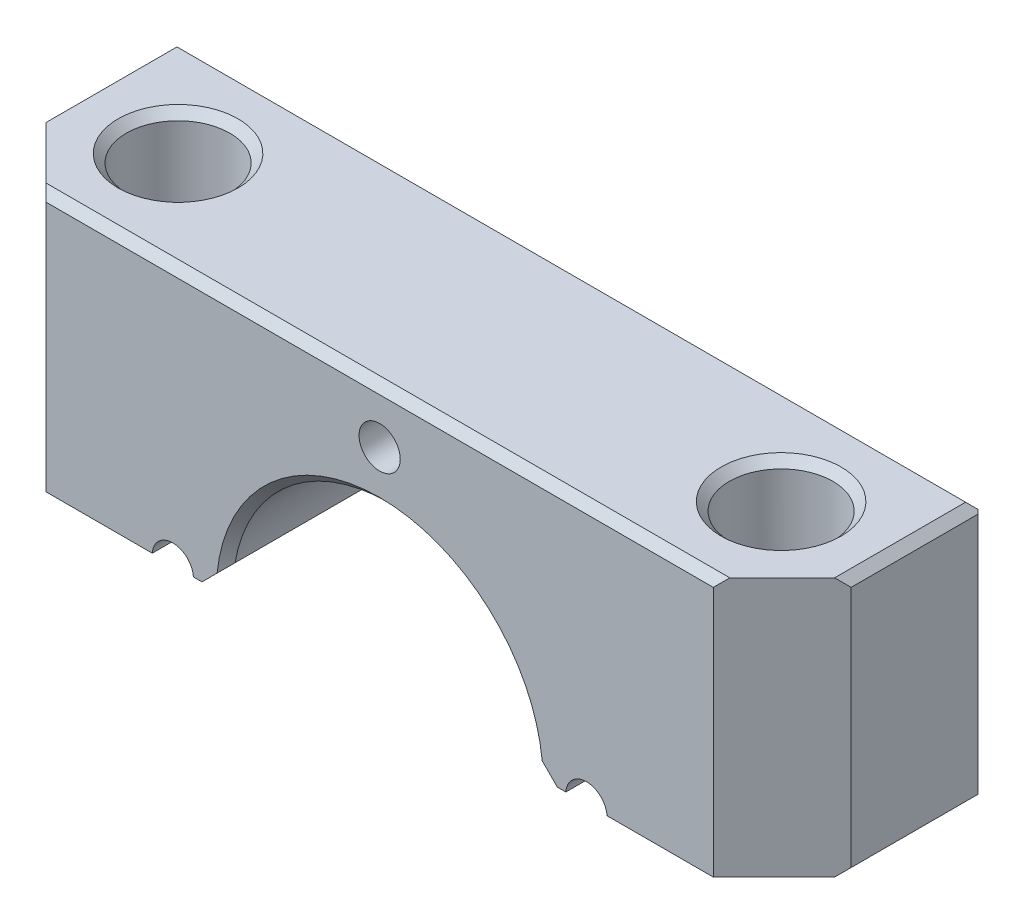
ISO-10303-21;
HEADER;
FILE_DESCRIPTION(('STEP AP214'),'2;1');
FILE_NAME('part.step','',(''),(''),'','','');
FILE_SCHEMA(('AUTOMOTIVE_DESIGN { 1 0 10303 214 1 1 1 1 }'));
ENDSEC;
DATA;
#1=APPLICATION_CONTEXT('core data for automotive mechanical design processes');
#2=APPLICATION_PROTOCOL_DEFINITION('international standard','automotive_design',2000,#1);
#3=PRODUCT_CONTEXT('',#1,'mechanical');
#4=PRODUCT('Part','Part','',(#3));
#5=PRODUCT_RELATED_PRODUCT_CATEGORY('part','',(#4));
#6=PRODUCT_DEFINITION_FORMATION('','',#4);
#7=PRODUCT_DEFINITION_CONTEXT('part definition',#1,'design');
#8=PRODUCT_DEFINITION('design','',#6,#7);
#9=PRODUCT_DEFINITION_SHAPE('','',#8);
#10=(LENGTH_UNIT() NAMED_UNIT(*) SI_UNIT(.MILLI.,.METRE.));
#11=(NAMED_UNIT(*) PLANE_ANGLE_UNIT() SI_UNIT($,.RADIAN.));
#12=(NAMED_UNIT(*) SI_UNIT($,.STERADIAN.) SOLID_ANGLE_UNIT());
#13=UNCERTAINTY_MEASURE_WITH_UNIT(LENGTH_MEASURE(1.E-05),#10,'distance_accuracy_value','');
#14=(GEOMETRIC_REPRESENTATION_CONTEXT(3) GLOBAL_UNCERTAINTY_ASSIGNED_CONTEXT((#13)) GLOBAL_UNIT_ASSIGNED_CONTEXT((#10,
#11,#12)) REPRESENTATION_CONTEXT('',''));
#15=CARTESIAN_POINT('',(0.,0.,0.));
#16=DIRECTION('',(0.,0.,1.));
#17=DIRECTION('',(1.,0.,0.));
#18=AXIS2_PLACEMENT_3D('',#15,#16,#17);
#19=CARTESIAN_POINT('',(-37.084,0.,18.415));
#20=DIRECTION('',(0.,1.,0.));
#21=DIRECTION('',(-1.,0.,0.));
#22=AXIS2_PLACEMENT_3D('',#19,#20,#21);
#23=PLANE('',#22);
#24=CARTESIAN_POINT('',(-27.7749,0.,9.2075));
#25=DIRECTION('',(0.,1.,0.));
#26=DIRECTION('',(0.,0.,1.));
#27=AXIS2_PLACEMENT_3D('',#24,#25,#26);
#28=CIRCLE('',#27,4.76249999999999);
#29=CARTESIAN_POINT('',(-27.7749,0.,13.97));
#30=VERTEX_POINT('',#29);
#31=EDGE_CURVE('E296',#30,#30,#28,.T.);
#32=ORIENTED_EDGE('',*,*,#31,.T.);
#33=EDGE_LOOP('',(#32));
#34=FACE_BOUND('',#33,.T.);
#35=DIRECTION('',(0.707106781186546,0.,0.707106781186549));
#36=VECTOR('',#35,1.);
#37=CARTESIAN_POINT('',(-30.734,0.,18.415));
#38=LINE('',#37,#36);
#39=CARTESIAN_POINT('',(-30.734,0.,18.415));
#40=VERTEX_POINT('',#39);
#41=CARTESIAN_POINT('',(-36.322,0.,12.827));
#42=VERTEX_POINT('',#41);
#43=EDGE_CURVE('E451',#40,#42,#38,.F.);
#44=ORIENTED_EDGE('',*,*,#43,.T.);
#45=DIRECTION('',(0.,0.,-1.));
#46=VECTOR('',#45,1.);
#47=CARTESIAN_POINT('',(-36.322,0.,18.415));
#48=LINE('',#47,#46);
#49=CARTESIAN_POINT('',(-36.322,0.,0.));
#50=VERTEX_POINT('',#49);
#51=EDGE_CURVE('E233',#42,#50,#48,.T.);
#52=ORIENTED_EDGE('',*,*,#51,.T.);
#53=DIRECTION('',(1.,0.,0.));
#54=VECTOR('',#53,1.);
#55=CARTESIAN_POINT('',(-37.084,0.,0.));
#56=LINE('',#55,#54);
#57=CARTESIAN_POINT('',(-20.9443977466467,0.,0.));
#58=VERTEX_POINT('',#57);
#59=EDGE_CURVE('E227',#50,#58,#56,.T.);
#60=ORIENTED_EDGE('',*,*,#59,.T.);
#61=DIRECTION('',(0.,0.,1.));
#62=VECTOR('',#61,1.);
#63=CARTESIAN_POINT('',(-20.9443977466467,0.,18.415));
#64=LINE('',#63,#62);
#65=CARTESIAN_POINT('',(-20.9443977466467,0.,18.415));
#66=VERTEX_POINT('',#65);
#67=EDGE_CURVE('E231',#58,#66,#64,.T.);
#68=ORIENTED_EDGE('',*,*,#67,.T.);
#69=DIRECTION('',(1.,0.,0.));
#70=VECTOR('',#69,1.);
#71=CARTESIAN_POINT('',(-37.084,0.,18.415));
#72=LINE('',#71,#70);
#73=EDGE_CURVE('E305',#40,#66,#72,.T.);
#74=ORIENTED_EDGE('',*,*,#73,.F.);
#75=EDGE_LOOP('',(#44,#52,#60,#68,#74));
#76=FACE_BOUND('',#75,.T.);
#77=ADVANCED_FACE('F65',(#34,#76),#23,.F.);
#78=CARTESIAN_POINT('',(16.3682614394848,0.,0.));
#79=VERTEX_POINT('',#78);
#80=CARTESIAN_POINT('',(17.1556022533533,0.,0.));
#81=VERTEX_POINT('',#80);
#82=EDGE_CURVE('E239',#79,#81,#56,.T.);
#83=ORIENTED_EDGE('',*,*,#82,.T.);
#84=DIRECTION('',(0.,0.,1.));
#85=VECTOR('',#84,1.);
#86=CARTESIAN_POINT('',(17.1556022533533,0.,18.415));
#87=LINE('',#86,#85);
#88=CARTESIAN_POINT('',(17.1556022533533,0.,18.415));
#89=VERTEX_POINT('',#88);
#90=EDGE_CURVE('E267',#81,#89,#87,.T.);
#91=ORIENTED_EDGE('',*,*,#90,.T.);
#92=CARTESIAN_POINT('',(16.3682614394848,0.,18.415));
#93=VERTEX_POINT('',#92);
#94=EDGE_CURVE('E308',#93,#89,#72,.T.);
#95=ORIENTED_EDGE('',*,*,#94,.F.);
#96=DIRECTION('',(0.,0.,-1.));
#97=VECTOR('',#96,1.);
#98=CARTESIAN_POINT('',(16.3682614394848,0.,18.415));
#99=LINE('',#98,#97);
#100=EDGE_CURVE('E293',#93,#79,#99,.T.);
#101=ORIENTED_EDGE('',*,*,#100,.T.);
#102=EDGE_LOOP('',(#83,#91,#95,#101));
#103=FACE_BOUND('',#102,.T.);
#104=ADVANCED_FACE('F354',(#103),#23,.F.);
#105=CARTESIAN_POINT('',(-37.084,23.876,18.415));
#106=DIRECTION('',(0.,0.,-1.));
#107=DIRECTION('',(-1.,0.,0.));
#108=AXIS2_PLACEMENT_3D('',#105,#106,#107);
#109=PLANE('',#108);
#110=CARTESIAN_POINT('',(0.,18.923,18.415));
#111=DIRECTION('',(0.,0.,1.));
#112=DIRECTION('',(1.,0.,0.));
#113=AXIS2_PLACEMENT_3D('',#110,#111,#112);
#114=CIRCLE('',#113,1.89864999999999);
#115=CARTESIAN_POINT('',(1.89864999999999,18.923,18.415));
#116=VERTEX_POINT('',#115);
#117=EDGE_CURVE('E270',#116,#116,#114,.T.);
#118=ORIENTED_EDGE('',*,*,#117,.F.);
#119=EDGE_LOOP('',(#118));
#120=FACE_BOUND('',#119,.T.);
#121=CARTESIAN_POINT('',(20.9443977466467,0.,18.415));
#122=VERTEX_POINT('',#121);
#123=CARTESIAN_POINT('',(30.734,0.,18.415));
#124=VERTEX_POINT('',#123);
#125=EDGE_CURVE('E236',#122,#124,#72,.T.);
#126=ORIENTED_EDGE('',*,*,#125,.T.);
#127=DIRECTION('',(0.,1.,0.));
#128=VECTOR('',#127,1.);
#129=CARTESIAN_POINT('',(30.734,23.876,18.415));
#130=LINE('',#129,#128);
#131=CARTESIAN_POINT('',(30.734,23.114,18.415));
#132=VERTEX_POINT('',#131);
#133=EDGE_CURVE('E432',#124,#132,#130,.T.);
#134=ORIENTED_EDGE('',*,*,#133,.T.);
#135=DIRECTION('',(-1.,0.,0.));
#136=VECTOR('',#135,1.);
#137=CARTESIAN_POINT('',(-37.084,23.114,18.415));
#138=LINE('',#137,#136);
#139=CARTESIAN_POINT('',(-30.734,23.114,18.415));
#140=VERTEX_POINT('',#139);
#141=EDGE_CURVE('E411',#132,#140,#138,.T.);
#142=ORIENTED_EDGE('',*,*,#141,.T.);
#143=DIRECTION('',(0.,-1.,0.));
#144=VECTOR('',#143,1.);
#145=CARTESIAN_POINT('',(-30.734,23.876,18.415));
#146=LINE('',#145,#144);
#147=EDGE_CURVE('E426',#140,#40,#146,.T.);
#148=ORIENTED_EDGE('',*,*,#147,.T.);
#149=ORIENTED_EDGE('',*,*,#73,.T.);
#150=CARTESIAN_POINT('',(-19.05,-0.127,18.415));
#151=DIRECTION('',(0.,0.,1.));
#152=DIRECTION('',(1.,0.,0.));
#153=AXIS2_PLACEMENT_3D('',#150,#151,#152);
#154=CIRCLE('',#153,1.89864999999999);
#155=CARTESIAN_POINT('',(-17.1556022533533,0.,18.415));
#156=VERTEX_POINT('',#155);
#157=EDGE_CURVE('E246',#156,#66,#154,.T.);
#158=ORIENTED_EDGE('',*,*,#157,.F.);
#159=CARTESIAN_POINT('',(-16.3682614394848,0.,18.415));
#160=VERTEX_POINT('',#159);
#161=EDGE_CURVE('E307',#156,#160,#72,.T.);
#162=ORIENTED_EDGE('',*,*,#161,.T.);
#163=DIRECTION('',(0.707106781186548,0.707106781186547,0.));
#164=VECTOR('',#163,1.);
#165=CARTESIAN_POINT('',(-14.0822614394848,2.286,18.415));
#166=LINE('',#165,#164);
#167=CARTESIAN_POINT('',(-14.9722357368242,1.39602570266061,18.415));
#168=VERTEX_POINT('',#167);
#169=EDGE_CURVE('E277',#160,#168,#166,.T.);
#170=ORIENTED_EDGE('',*,*,#169,.T.);
#171=CARTESIAN_POINT('',(0.,-0.127,18.415));
#172=DIRECTION('',(0.,0.,-1.));
#173=DIRECTION('',(-1.,0.,0.));
#174=AXIS2_PLACEMENT_3D('',#171,#172,#173);
#175=CIRCLE('',#174,15.0495);
#176=CARTESIAN_POINT('',(14.9722357368242,1.39602570266061,18.415));
#177=VERTEX_POINT('',#176);
#178=EDGE_CURVE('E306',#168,#177,#175,.T.);
#179=ORIENTED_EDGE('',*,*,#178,.T.);
#180=DIRECTION('',(0.707106781186548,-0.707106781186548,0.));
#181=VECTOR('',#180,1.);
#182=CARTESIAN_POINT('',(16.3682614394848,0.,18.415));
#183=LINE('',#182,#181);
#184=EDGE_CURVE('E289',#177,#93,#183,.T.);
#185=ORIENTED_EDGE('',*,*,#184,.T.);
#186=ORIENTED_EDGE('',*,*,#94,.T.);
#187=CARTESIAN_POINT('',(19.05,-0.126999999999995,18.415));
#188=DIRECTION('',(0.,0.,1.));
#189=DIRECTION('',(1.,0.,0.));
#190=AXIS2_PLACEMENT_3D('',#187,#188,#189);
#191=CIRCLE('',#190,1.89864999999999);
#192=EDGE_CURVE('E255',#122,#89,#191,.T.);
#193=ORIENTED_EDGE('',*,*,#192,.F.);
#194=EDGE_LOOP('',(#126,#134,#142,#148,#149,#158,#162,#170,#179,#185,#186,#193));
#195=FACE_BOUND('',#194,.T.);
#196=ADVANCED_FACE('F351',(#120,#195),#109,.F.);
#197=CARTESIAN_POINT('',(-37.084,23.876,0.));
#198=DIRECTION('',(0.,0.,-1.));
#199=DIRECTION('',(-1.,0.,0.));
#200=AXIS2_PLACEMENT_3D('',#197,#198,#199);
#201=PLANE('',#200);
#202=DIRECTION('',(0.,-1.,0.));
#203=VECTOR('',#202,1.);
#204=CARTESIAN_POINT('',(36.703,0.,0.));
#205=LINE('',#204,#203);
#206=CARTESIAN_POINT('',(36.703,23.114,0.));
#207=VERTEX_POINT('',#206);
#208=CARTESIAN_POINT('',(36.703,0.381000000000034,0.));
#209=VERTEX_POINT('',#208);
#210=EDGE_CURVE('E467',#207,#209,#205,.T.);
#211=ORIENTED_EDGE('',*,*,#210,.T.);
#212=DIRECTION('',(0.707106781186551,0.707106781186544,0.));
#213=VECTOR('',#212,1.);
#214=CARTESIAN_POINT('',(11.5569999999996,-24.7650000000001,0.));
#215=LINE('',#214,#213);
#216=CARTESIAN_POINT('',(36.322,0.,0.));
#217=VERTEX_POINT('',#216);
#218=EDGE_CURVE('E480',#209,#217,#215,.F.);
#219=ORIENTED_EDGE('',*,*,#218,.T.);
#220=CARTESIAN_POINT('',(20.9443977466467,0.,0.));
#221=VERTEX_POINT('',#220);
#222=EDGE_CURVE('E304',#221,#217,#56,.T.);
#223=ORIENTED_EDGE('',*,*,#222,.F.);
#224=CARTESIAN_POINT('',(19.05,-0.126999999999995,0.));
#225=DIRECTION('',(0.,0.,1.));
#226=DIRECTION('',(1.,0.,0.));
#227=AXIS2_PLACEMENT_3D('',#224,#225,#226);
#228=CIRCLE('',#227,1.89864999999999);
#229=EDGE_CURVE('E257',#221,#81,#228,.T.);
#230=ORIENTED_EDGE('',*,*,#229,.T.);
#231=ORIENTED_EDGE('',*,*,#82,.F.);
#232=DIRECTION('',(0.707106781186548,-0.707106781186548,0.));
#233=VECTOR('',#232,1.);
#234=CARTESIAN_POINT('',(16.3682614394848,0.,0.));
#235=LINE('',#234,#233);
#236=CARTESIAN_POINT('',(14.9722357368242,1.39602570266061,0.));
#237=VERTEX_POINT('',#236);
#238=EDGE_CURVE('E286',#237,#79,#235,.T.);
#239=ORIENTED_EDGE('',*,*,#238,.F.);
#240=CARTESIAN_POINT('',(0.,-0.127,0.));
#241=DIRECTION('',(0.,0.,-1.));
#242=DIRECTION('',(-1.,0.,0.));
#243=AXIS2_PLACEMENT_3D('',#240,#241,#242);
#244=CIRCLE('',#243,15.0495);
#245=CARTESIAN_POINT('',(-14.9722357368242,1.39602570266061,0.));
#246=VERTEX_POINT('',#245);
#247=EDGE_CURVE('E384',#237,#246,#244,.F.);
#248=ORIENTED_EDGE('',*,*,#247,.T.);
#249=DIRECTION('',(0.707106781186548,0.707106781186547,0.));
#250=VECTOR('',#249,1.);
#251=CARTESIAN_POINT('',(-14.0822614394848,2.286,0.));
#252=LINE('',#251,#250);
#253=CARTESIAN_POINT('',(-16.3682614394848,0.,0.));
#254=VERTEX_POINT('',#253);
#255=EDGE_CURVE('E276',#254,#246,#252,.T.);
#256=ORIENTED_EDGE('',*,*,#255,.F.);
#257=CARTESIAN_POINT('',(-17.1556022533533,0.,0.));
#258=VERTEX_POINT('',#257);
#259=EDGE_CURVE('E237',#258,#254,#56,.T.);
#260=ORIENTED_EDGE('',*,*,#259,.F.);
#261=CARTESIAN_POINT('',(-19.05,-0.127,0.));
#262=DIRECTION('',(0.,0.,1.));
#263=DIRECTION('',(1.,0.,0.));
#264=AXIS2_PLACEMENT_3D('',#261,#262,#263);
#265=CIRCLE('',#264,1.89864999999999);
#266=EDGE_CURVE('E243',#258,#58,#265,.T.);
#267=ORIENTED_EDGE('',*,*,#266,.T.);
#268=ORIENTED_EDGE('',*,*,#59,.F.);
#269=DIRECTION('',(0.707106781186551,-0.707106781186544,0.));
#270=VECTOR('',#269,1.);
#271=CARTESIAN_POINT('',(-48.641,12.3189999999999,0.));
#272=LINE('',#271,#270);
#273=CARTESIAN_POINT('',(-36.703,0.380999999999996,0.));
#274=VERTEX_POINT('',#273);
#275=EDGE_CURVE('E478',#50,#274,#272,.F.);
#276=ORIENTED_EDGE('',*,*,#275,.T.);
#277=DIRECTION('',(0.,1.,0.));
#278=VECTOR('',#277,1.);
#279=CARTESIAN_POINT('',(-36.703,23.114,0.));
#280=LINE('',#279,#278);
#281=CARTESIAN_POINT('',(-36.703,23.114,0.));
#282=VERTEX_POINT('',#281);
#283=EDGE_CURVE('E465',#274,#282,#280,.T.);
#284=ORIENTED_EDGE('',*,*,#283,.T.);
#285=DIRECTION('',(1.,0.,0.));
#286=VECTOR('',#285,1.);
#287=CARTESIAN_POINT('',(37.084,23.114,0.));
#288=LINE('',#287,#286);
#289=EDGE_CURVE('E417',#282,#207,#288,.T.);
#290=ORIENTED_EDGE('',*,*,#289,.T.);
#291=EDGE_LOOP('',(#211,#219,#223,#230,#231,#239,#248,#256,#260,#267,#268,#276,#284,#290));
#292=FACE_BOUND('',#291,.T.);
#293=CARTESIAN_POINT('',(0.,18.923,0.));
#294=DIRECTION('',(0.,0.,1.));
#295=DIRECTION('',(1.,0.,0.));
#296=AXIS2_PLACEMENT_3D('',#293,#294,#295);
#297=CIRCLE('',#296,1.89865);
#298=CARTESIAN_POINT('',(1.89865,18.923,0.));
#299=VERTEX_POINT('',#298);
#300=EDGE_CURVE('E273',#299,#299,#297,.T.);
#301=ORIENTED_EDGE('',*,*,#300,.T.);
#302=EDGE_LOOP('',(#301));
#303=FACE_BOUND('',#302,.T.);
#304=ADVANCED_FACE('F252',(#292,#303),#201,.T.);
#305=CARTESIAN_POINT('',(27.7749,0.,9.20749999999999));
#306=DIRECTION('',(0.,1.,0.));
#307=DIRECTION('',(0.,0.,1.));
#308=AXIS2_PLACEMENT_3D('',#305,#306,#307);
#309=CIRCLE('',#308,4.76249999999999);
#310=CARTESIAN_POINT('',(27.7749,0.,13.97));
#311=VERTEX_POINT('',#310);
#312=EDGE_CURVE('E301',#311,#311,#309,.T.);
#313=ORIENTED_EDGE('',*,*,#312,.T.);
#314=EDGE_LOOP('',(#313));
#315=FACE_BOUND('',#314,.T.);
#316=ORIENTED_EDGE('',*,*,#222,.T.);
#317=DIRECTION('',(0.,0.,1.));
#318=VECTOR('',#317,1.);
#319=CARTESIAN_POINT('',(36.322,0.,18.415));
#320=LINE('',#319,#318);
#321=CARTESIAN_POINT('',(36.322,0.,12.827));
#322=VERTEX_POINT('',#321);
#323=EDGE_CURVE('E482',#217,#322,#320,.T.);
#324=ORIENTED_EDGE('',*,*,#323,.T.);
#325=DIRECTION('',(0.707106781186546,0.,-0.707106781186549));
#326=VECTOR('',#325,1.);
#327=CARTESIAN_POINT('',(30.734,0.,18.415));
#328=LINE('',#327,#326);
#329=EDGE_CURVE('E449',#322,#124,#328,.F.);
#330=ORIENTED_EDGE('',*,*,#329,.T.);
#331=ORIENTED_EDGE('',*,*,#125,.F.);
#332=DIRECTION('',(0.,0.,1.));
#333=VECTOR('',#332,1.);
#334=CARTESIAN_POINT('',(20.9443977466467,0.,18.415));
#335=LINE('',#334,#333);
#336=EDGE_CURVE('E264',#122,#221,#335,.F.);
#337=ORIENTED_EDGE('',*,*,#336,.T.);
#338=EDGE_LOOP('',(#316,#324,#330,#331,#337));
#339=FACE_BOUND('',#338,.T.);
#340=ADVANCED_FACE('F358',(#315,#339),#23,.F.);
#341=CARTESIAN_POINT('',(-37.084,0.,18.415));
#342=DIRECTION('',(1.,0.,0.));
#343=DIRECTION('',(0.,1.,0.));
#344=AXIS2_PLACEMENT_3D('',#341,#342,#343);
#345=PLANE('',#344);
#346=DIRECTION('',(0.,-1.,0.));
#347=VECTOR('',#346,1.);
#348=CARTESIAN_POINT('',(-37.084,0.,0.380999999999999));
#349=LINE('',#348,#347);
#350=CARTESIAN_POINT('',(-37.084,23.114,0.380999999999997));
#351=VERTEX_POINT('',#350);
#352=CARTESIAN_POINT('',(-37.084,0.761999999999992,0.380999999999999));
#353=VERTEX_POINT('',#352);
#354=EDGE_CURVE('E469',#351,#353,#349,.T.);
#355=ORIENTED_EDGE('',*,*,#354,.T.);
#356=DIRECTION('',(0.,0.,1.));
#357=VECTOR('',#356,1.);
#358=CARTESIAN_POINT('',(-37.084,0.761999999999992,18.415));
#359=LINE('',#358,#357);
#360=CARTESIAN_POINT('',(-37.084,0.761999999999989,12.065));
#361=VERTEX_POINT('',#360);
#362=EDGE_CURVE('E73',#353,#361,#359,.T.);
#363=ORIENTED_EDGE('',*,*,#362,.T.);
#364=DIRECTION('',(0.,1.,0.));
#365=VECTOR('',#364,1.);
#366=CARTESIAN_POINT('',(-37.084,0.,12.065));
#367=LINE('',#366,#365);
#368=CARTESIAN_POINT('',(-37.084,23.114,12.065));
#369=VERTEX_POINT('',#368);
#370=EDGE_CURVE('E453',#361,#369,#367,.T.);
#371=ORIENTED_EDGE('',*,*,#370,.T.);
#372=DIRECTION('',(0.,0.,-1.));
#373=VECTOR('',#372,1.);
#374=CARTESIAN_POINT('',(-37.084,23.114,18.415));
#375=LINE('',#374,#373);
#376=EDGE_CURVE('E414',#369,#351,#375,.T.);
#377=ORIENTED_EDGE('',*,*,#376,.T.);
#378=EDGE_LOOP('',(#355,#363,#371,#377));
#379=FACE_BOUND('',#378,.T.);
#380=ADVANCED_FACE('F369',(#379),#345,.F.);
#381=ORIENTED_EDGE('',*,*,#161,.F.);
#382=DIRECTION('',(0.,0.,1.));
#383=VECTOR('',#382,1.);
#384=CARTESIAN_POINT('',(-17.1556022533533,0.,18.415));
#385=LINE('',#384,#383);
#386=EDGE_CURVE('E248',#156,#258,#385,.F.);
#387=ORIENTED_EDGE('',*,*,#386,.T.);
#388=ORIENTED_EDGE('',*,*,#259,.T.);
#389=DIRECTION('',(0.,0.,-1.));
#390=VECTOR('',#389,1.);
#391=CARTESIAN_POINT('',(-16.3682614394848,0.,18.415));
#392=LINE('',#391,#390);
#393=EDGE_CURVE('E280',#160,#254,#392,.T.);
#394=ORIENTED_EDGE('',*,*,#393,.F.);
#395=EDGE_LOOP('',(#381,#387,#388,#394));
#396=FACE_BOUND('',#395,.T.);
#397=ADVANCED_FACE('F365',(#396),#23,.F.);
#398=CARTESIAN_POINT('',(37.084,0.,18.415));
#399=DIRECTION('',(-1.,0.,0.));
#400=DIRECTION('',(0.,0.,1.));
#401=AXIS2_PLACEMENT_3D('',#398,#399,#400);
#402=PLANE('',#401);
#403=DIRECTION('',(0.,-1.,0.));
#404=VECTOR('',#403,1.);
#405=CARTESIAN_POINT('',(37.084,0.,12.065));
#406=LINE('',#405,#404);
#407=CARTESIAN_POINT('',(37.084,23.114,12.065));
#408=VERTEX_POINT('',#407);
#409=CARTESIAN_POINT('',(37.084,0.762000000000015,12.065));
#410=VERTEX_POINT('',#409);
#411=EDGE_CURVE('E446',#408,#410,#406,.T.);
#412=ORIENTED_EDGE('',*,*,#411,.T.);
#413=DIRECTION('',(0.,0.,-1.));
#414=VECTOR('',#413,1.);
#415=CARTESIAN_POINT('',(37.084,0.762000000000019,18.415));
#416=LINE('',#415,#414);
#417=CARTESIAN_POINT('',(37.084,0.762000000000017,0.380999999999999));
#418=VERTEX_POINT('',#417);
#419=EDGE_CURVE('E473',#410,#418,#416,.T.);
#420=ORIENTED_EDGE('',*,*,#419,.T.);
#421=DIRECTION('',(0.,1.,0.));
#422=VECTOR('',#421,1.);
#423=CARTESIAN_POINT('',(37.084,23.114,0.380999999999999));
#424=LINE('',#423,#422);
#425=CARTESIAN_POINT('',(37.084,23.114,0.380999999999996));
#426=VERTEX_POINT('',#425);
#427=EDGE_CURVE('E457',#418,#426,#424,.T.);
#428=ORIENTED_EDGE('',*,*,#427,.T.);
#429=DIRECTION('',(0.,0.,1.));
#430=VECTOR('',#429,1.);
#431=CARTESIAN_POINT('',(37.084,23.114,18.415));
#432=LINE('',#431,#430);
#433=EDGE_CURVE('E409',#426,#408,#432,.T.);
#434=ORIENTED_EDGE('',*,*,#433,.T.);
#435=EDGE_LOOP('',(#412,#420,#428,#434));
#436=FACE_BOUND('',#435,.T.);
#437=ADVANCED_FACE('F361',(#436),#402,.F.);
#438=CARTESIAN_POINT('',(-37.084,23.876,18.415));
#439=DIRECTION('',(0.,-1.,0.));
#440=DIRECTION('',(1.,0.,0.));
#441=AXIS2_PLACEMENT_3D('',#438,#439,#440);
#442=PLANE('',#441);
#443=DIRECTION('',(1.,0.,0.));
#444=VECTOR('',#443,1.);
#445=CARTESIAN_POINT('',(-37.084,23.876,17.653));
#446=LINE('',#445,#444);
#447=CARTESIAN_POINT('',(-31.496,23.876,17.653));
#448=VERTEX_POINT('',#447);
#449=CARTESIAN_POINT('',(31.496,23.876,17.653));
#450=VERTEX_POINT('',#449);
#451=EDGE_CURVE('E403',#448,#450,#446,.T.);
#452=ORIENTED_EDGE('',*,*,#451,.T.);
#453=DIRECTION('',(-0.707106781186546,0.,0.707106781186549));
#454=VECTOR('',#453,1.);
#455=CARTESIAN_POINT('',(30.734,23.876,18.415));
#456=LINE('',#455,#454);
#457=CARTESIAN_POINT('',(36.322,23.876,12.827));
#458=VERTEX_POINT('',#457);
#459=EDGE_CURVE('E441',#450,#458,#456,.F.);
#460=ORIENTED_EDGE('',*,*,#459,.T.);
#461=DIRECTION('',(0.,0.,-1.));
#462=VECTOR('',#461,1.);
#463=CARTESIAN_POINT('',(36.322,23.876,18.415));
#464=LINE('',#463,#462);
#465=CARTESIAN_POINT('',(36.322,23.876,0.761999999999992));
#466=VERTEX_POINT('',#465);
#467=EDGE_CURVE('E406',#458,#466,#464,.T.);
#468=ORIENTED_EDGE('',*,*,#467,.T.);
#469=DIRECTION('',(-1.,0.,0.));
#470=VECTOR('',#469,1.);
#471=CARTESIAN_POINT('',(-37.084,23.876,0.761999999999992));
#472=LINE('',#471,#470);
#473=CARTESIAN_POINT('',(-36.322,23.876,0.761999999999992));
#474=VERTEX_POINT('',#473);
#475=EDGE_CURVE('E397',#466,#474,#472,.T.);
#476=ORIENTED_EDGE('',*,*,#475,.T.);
#477=DIRECTION('',(0.,0.,1.));
#478=VECTOR('',#477,1.);
#479=CARTESIAN_POINT('',(-36.322,23.876,18.415));
#480=LINE('',#479,#478);
#481=CARTESIAN_POINT('',(-36.322,23.876,12.827));
#482=VERTEX_POINT('',#481);
#483=EDGE_CURVE('E400',#474,#482,#480,.T.);
#484=ORIENTED_EDGE('',*,*,#483,.T.);
#485=DIRECTION('',(-0.707106781186546,0.,-0.707106781186549));
#486=VECTOR('',#485,1.);
#487=CARTESIAN_POINT('',(-30.734,23.876,18.415));
#488=LINE('',#487,#486);
#489=EDGE_CURVE('E439',#482,#448,#488,.F.);
#490=ORIENTED_EDGE('',*,*,#489,.T.);
#491=EDGE_LOOP('',(#452,#460,#468,#476,#484,#490));
#492=FACE_BOUND('',#491,.T.);
#493=CARTESIAN_POINT('',(27.7749,23.876,9.20749999999999));
#494=DIRECTION('',(0.,-1.,0.));
#495=DIRECTION('',(1.,0.,0.));
#496=AXIS2_PLACEMENT_3D('',#493,#494,#495);
#497=CIRCLE('',#496,5.52449999999999);
#498=CARTESIAN_POINT('',(33.2994,23.876,9.20749999999999));
#499=VERTEX_POINT('',#498);
#500=EDGE_CURVE('E394',#499,#499,#497,.T.);
#501=ORIENTED_EDGE('',*,*,#500,.T.);
#502=EDGE_LOOP('',(#501));
#503=FACE_BOUND('',#502,.T.);
#504=CARTESIAN_POINT('',(-27.7749,23.876,9.2075));
#505=DIRECTION('',(0.,-1.,0.));
#506=DIRECTION('',(1.,0.,0.));
#507=AXIS2_PLACEMENT_3D('',#504,#505,#506);
#508=CIRCLE('',#507,5.5245);
#509=CARTESIAN_POINT('',(-22.2504,23.876,9.2075));
#510=VERTEX_POINT('',#509);
#511=EDGE_CURVE('E247',#510,#510,#508,.T.);
#512=ORIENTED_EDGE('',*,*,#511,.T.);
#513=EDGE_LOOP('',(#512));
#514=FACE_BOUND('',#513,.T.);
#515=ADVANCED_FACE('F349',(#492,#503,#514),#442,.F.);
#516=CARTESIAN_POINT('',(27.7749,23.876,9.20749999999999));
#517=DIRECTION('',(0.,1.,0.));
#518=DIRECTION('',(0.,0.,1.));
#519=AXIS2_PLACEMENT_3D('',#516,#517,#518);
#520=CYLINDRICAL_SURFACE('',#519,4.7625);
#521=CARTESIAN_POINT('',(27.7749,23.114,9.20749999999999));
#522=DIRECTION('',(0.,-1.,0.));
#523=DIRECTION('',(0.,0.,-1.));
#524=AXIS2_PLACEMENT_3D('',#521,#522,#523);
#525=CIRCLE('',#524,4.7625);
#526=CARTESIAN_POINT('',(27.7749,23.114,4.445));
#527=VERTEX_POINT('',#526);
#528=EDGE_CURVE('E420',#527,#527,#525,.F.);
#529=ORIENTED_EDGE('',*,*,#528,.T.);
#530=EDGE_LOOP('',(#529));
#531=FACE_BOUND('',#530,.T.);
#532=ORIENTED_EDGE('',*,*,#312,.F.);
#533=EDGE_LOOP('',(#532));
#534=FACE_BOUND('',#533,.T.);
#535=ADVANCED_FACE('F345',(#531,#534),#520,.F.);
#536=CARTESIAN_POINT('',(-27.7749,23.876,9.2075));
#537=DIRECTION('',(0.,1.,0.));
#538=DIRECTION('',(0.,0.,1.));
#539=AXIS2_PLACEMENT_3D('',#536,#537,#538);
#540=CYLINDRICAL_SURFACE('',#539,4.76249999999999);
#541=CARTESIAN_POINT('',(-27.7749,23.114,9.2075));
#542=DIRECTION('',(0.,-1.,0.));
#543=DIRECTION('',(0.,0.,-1.));
#544=AXIS2_PLACEMENT_3D('',#541,#542,#543);
#545=CIRCLE('',#544,4.76249999999999);
#546=CARTESIAN_POINT('',(-27.7749,23.114,4.445));
#547=VERTEX_POINT('',#546);
#548=EDGE_CURVE('E423',#547,#547,#545,.F.);
#549=ORIENTED_EDGE('',*,*,#548,.T.);
#550=EDGE_LOOP('',(#549));
#551=FACE_BOUND('',#550,.T.);
#552=ORIENTED_EDGE('',*,*,#31,.F.);
#553=EDGE_LOOP('',(#552));
#554=FACE_BOUND('',#553,.T.);
#555=ADVANCED_FACE('F341',(#551,#554),#540,.F.);
#556=CARTESIAN_POINT('',(0.,-0.127,18.415));
#557=DIRECTION('',(0.,0.,-1.));
#558=DIRECTION('',(-1.,0.,0.));
#559=AXIS2_PLACEMENT_3D('',#556,#557,#558);
#560=CYLINDRICAL_SURFACE('',#559,14.2875);
#561=DIRECTION('',(0.,0.,-1.));
#562=VECTOR('',#561,1.);
#563=CARTESIAN_POINT('',(14.0822614394848,2.28600000000001,18.415));
#564=LINE('',#563,#562);
#565=CARTESIAN_POINT('',(14.0822614394848,2.28600000000001,17.653));
#566=VERTEX_POINT('',#565);
#567=CARTESIAN_POINT('',(14.0822614394848,2.28600000000001,0.761999999999992));
#568=VERTEX_POINT('',#567);
#569=EDGE_CURVE('E291',#566,#568,#564,.T.);
#570=ORIENTED_EDGE('',*,*,#569,.F.);
#571=CARTESIAN_POINT('',(0.,-0.127,17.653));
#572=DIRECTION('',(0.,0.,-1.));
#573=DIRECTION('',(-1.,0.,0.));
#574=AXIS2_PLACEMENT_3D('',#571,#572,#573);
#575=CIRCLE('',#574,14.2875);
#576=CARTESIAN_POINT('',(-14.0822614394848,2.286,17.653));
#577=VERTEX_POINT('',#576);
#578=EDGE_CURVE('E561',#566,#577,#575,.F.);
#579=ORIENTED_EDGE('',*,*,#578,.T.);
#580=DIRECTION('',(0.,0.,-1.));
#581=VECTOR('',#580,1.);
#582=CARTESIAN_POINT('',(-14.0822614394848,2.286,18.415));
#583=LINE('',#582,#581);
#584=CARTESIAN_POINT('',(-14.0822614394848,2.286,0.76199999999999));
#585=VERTEX_POINT('',#584);
#586=EDGE_CURVE('E283',#577,#585,#583,.T.);
#587=ORIENTED_EDGE('',*,*,#586,.T.);
#588=CARTESIAN_POINT('',(0.,-0.127,0.761999999999992));
#589=DIRECTION('',(0.,0.,-1.));
#590=DIRECTION('',(-1.,0.,0.));
#591=AXIS2_PLACEMENT_3D('',#588,#589,#590);
#592=CIRCLE('',#591,14.2875);
#593=EDGE_CURVE('E560',#585,#568,#592,.T.);
#594=ORIENTED_EDGE('',*,*,#593,.T.);
#595=EDGE_LOOP('',(#570,#579,#587,#594));
#596=FACE_BOUND('',#595,.T.);
#597=ADVANCED_FACE('F334',(#596),#560,.F.);
#598=CARTESIAN_POINT('',(16.3682614394848,0.,18.415));
#599=DIRECTION('',(0.707106781186548,0.707106781186548,0.));
#600=DIRECTION('',(-0.707106781186548,0.707106781186548,0.));
#601=AXIS2_PLACEMENT_3D('',#598,#599,#600);
#602=PLANE('',#601);
#603=ORIENTED_EDGE('',*,*,#184,.F.);
#604=CARTESIAN_POINT('',(14.9722357368242,1.39602570266061,18.415));
#605=CARTESIAN_POINT('',(14.8989367258847,1.46932471360011,18.3494960611935));
#606=CARTESIAN_POINT('',(14.8254324305764,1.54282900890841,18.28445037873));
#607=CARTESIAN_POINT('',(14.6780027121408,1.69025872734397,18.1553440447197));
#608=CARTESIAN_POINT('',(14.6040773313934,1.76418410809136,18.0912832963641));
#609=CARTESIAN_POINT('',(14.455779797506,1.9124816419788,17.9642018583802));
#610=CARTESIAN_POINT('',(14.3814076408146,1.98685379867022,17.9011811770341));
#611=CARTESIAN_POINT('',(14.2321913498823,2.13607008960247,17.7762436439655));
#612=CARTESIAN_POINT('',(14.1573471696705,2.21091426981429,17.7143269020767));
#613=CARTESIAN_POINT('',(14.0822614394848,2.28599999999996,17.6529999999999));
#614=B_SPLINE_CURVE_WITH_KNOTS('',3,(#604,#605,#606,#607,#608,#609,#610,#611,#612,#613),
.UNSPECIFIED.,.F.,.F.,(4,2,2,2,4),(0.,0.367866936481716,0.735697481314644,1.1035309538615,
1.47140082111056),.UNSPECIFIED.);
#615=EDGE_CURVE('E319',#177,#566,#614,.T.);
#616=ORIENTED_EDGE('',*,*,#615,.T.);
#617=ORIENTED_EDGE('',*,*,#569,.T.);
#618=CARTESIAN_POINT('',(14.0822614394848,2.28600000000001,0.761999999999992));
#619=CARTESIAN_POINT('',(14.1573471696705,2.21091426981431,0.700673097923273));
#620=CARTESIAN_POINT('',(14.2321913498823,2.13607008960247,0.638756356034444));
#621=CARTESIAN_POINT('',(14.3814076408146,1.98685379867021,0.513818822965908));
#622=CARTESIAN_POINT('',(14.455779797506,1.9124816419788,0.450798141619841));
#623=CARTESIAN_POINT('',(14.6040773313934,1.76418410809137,0.323716703635898));
#624=CARTESIAN_POINT('',(14.6780027121408,1.69025872734398,0.259655955280333));
#625=CARTESIAN_POINT('',(14.8254324305764,1.54282900890841,0.130549621270011));
#626=CARTESIAN_POINT('',(14.8989367258847,1.46932471360011,0.0655039388065291));
#627=CARTESIAN_POINT('',(14.9722357368242,1.39602570266059,0.));
#628=B_SPLINE_CURVE_WITH_KNOTS('',3,(#618,#619,#620,#621,#622,#623,#624,#625,#626,#627),
.UNSPECIFIED.,.F.,.F.,(4,2,2,2,4),(0.,0.367869867249062,0.735703339795919,1.10353388462885,
1.47140082111056),.UNSPECIFIED.);
#629=EDGE_CURVE('E312',#568,#237,#628,.T.);
#630=ORIENTED_EDGE('',*,*,#629,.T.);
#631=ORIENTED_EDGE('',*,*,#238,.T.);
#632=ORIENTED_EDGE('',*,*,#100,.F.);
#633=EDGE_LOOP('',(#603,#616,#617,#630,#631,#632));
#634=FACE_BOUND('',#633,.T.);
#635=ADVANCED_FACE('F328',(#634),#602,.F.);
#636=CARTESIAN_POINT('',(-14.0822614394848,2.286,18.415));
#637=DIRECTION('',(-0.707106781186547,0.707106781186548,0.));
#638=DIRECTION('',(-0.707106781186548,-0.707106781186547,0.));
#639=AXIS2_PLACEMENT_3D('',#636,#637,#638);
#640=PLANE('',#639);
#641=ORIENTED_EDGE('',*,*,#586,.F.);
#642=CARTESIAN_POINT('',(-14.0822614394848,2.286,17.653));
#643=CARTESIAN_POINT('',(-14.1573471696705,2.2109142698143,17.7143269020767));
#644=CARTESIAN_POINT('',(-14.2321913498823,2.13607008960247,17.7762436439655));
#645=CARTESIAN_POINT('',(-14.3814076408146,1.98685379867021,17.9011811770341));
#646=CARTESIAN_POINT('',(-14.455779797506,1.9124816419788,17.9642018583802));
#647=CARTESIAN_POINT('',(-14.6040773313934,1.76418410809136,18.0912832963641));
#648=CARTESIAN_POINT('',(-14.6780027121408,1.69025872734397,18.1553440447197));
#649=CARTESIAN_POINT('',(-14.8254324305764,1.5428290089084,18.28445037873));
#650=CARTESIAN_POINT('',(-14.8989367258847,1.4693247136001,18.3494960611935));
#651=CARTESIAN_POINT('',(-14.9722357368242,1.39602570266058,18.4149999999999));
#652=B_SPLINE_CURVE_WITH_KNOTS('',3,(#642,#643,#644,#645,#646,#647,#648,#649,#650,#651),
.UNSPECIFIED.,.F.,.F.,(4,2,2,2,4),(0.,0.367869867249063,0.73570333979592,1.10353388462884,
1.47140082111056),.UNSPECIFIED.);
#653=EDGE_CURVE('E378',#577,#168,#652,.T.);
#654=ORIENTED_EDGE('',*,*,#653,.T.);
#655=ORIENTED_EDGE('',*,*,#169,.F.);
#656=ORIENTED_EDGE('',*,*,#393,.T.);
#657=ORIENTED_EDGE('',*,*,#255,.T.);
#658=CARTESIAN_POINT('',(-14.9722357368242,1.39602570266061,0.));
#659=CARTESIAN_POINT('',(-14.8989367258847,1.46932471360011,0.0655039388065054));
#660=CARTESIAN_POINT('',(-14.8254324305764,1.5428290089084,0.130549621270004));
#661=CARTESIAN_POINT('',(-14.6780027121408,1.69025872734397,0.259655955280339));
#662=CARTESIAN_POINT('',(-14.6040773313934,1.76418410809136,0.323716703635901));
#663=CARTESIAN_POINT('',(-14.455779797506,1.9124816419788,0.450798141619835));
#664=CARTESIAN_POINT('',(-14.3814076408146,1.98685379867021,0.513818822965895));
#665=CARTESIAN_POINT('',(-14.2321913498823,2.13607008960246,0.638756356034452));
#666=CARTESIAN_POINT('',(-14.1573471696705,2.21091426981428,0.700673097923309));
#667=CARTESIAN_POINT('',(-14.0822614394848,2.28599999999996,0.762000000000092));
#668=B_SPLINE_CURVE_WITH_KNOTS('',3,(#658,#659,#660,#661,#662,#663,#664,#665,#666,#667),
.UNSPECIFIED.,.F.,.F.,(4,2,2,2,4),(0.,0.367866936481714,0.735697481314641,1.1035309538615,
1.47140082111056),.UNSPECIFIED.);
#669=EDGE_CURVE('E385',#246,#585,#668,.T.);
#670=ORIENTED_EDGE('',*,*,#669,.T.);
#671=EDGE_LOOP('',(#641,#654,#655,#656,#657,#670));
#672=FACE_BOUND('',#671,.T.);
#673=ADVANCED_FACE('F333',(#672),#640,.F.);
#674=CARTESIAN_POINT('',(0.,-0.127,18.415));
#675=DIRECTION('',(0.,0.,1.));
#676=DIRECTION('',(1.,0.,0.));
#677=AXIS2_PLACEMENT_3D('',#674,#675,#676);
#678=CONICAL_SURFACE('',#677,15.0495,0.785398163397447);
#679=ORIENTED_EDGE('',*,*,#653,.F.);
#680=ORIENTED_EDGE('',*,*,#578,.F.);
#681=ORIENTED_EDGE('',*,*,#615,.F.);
#682=ORIENTED_EDGE('',*,*,#178,.F.);
#683=EDGE_LOOP('',(#679,#680,#681,#682));
#684=FACE_BOUND('',#683,.T.);
#685=ADVANCED_FACE('F372',(#684),#678,.F.);
#686=CARTESIAN_POINT('',(0.,-0.127,0.761999999999992));
#687=DIRECTION('',(0.,0.,-1.));
#688=DIRECTION('',(-1.,0.,0.));
#689=AXIS2_PLACEMENT_3D('',#686,#687,#688);
#690=CONICAL_SURFACE('',#689,14.2875,0.785398163397452);
#691=ORIENTED_EDGE('',*,*,#669,.F.);
#692=ORIENTED_EDGE('',*,*,#247,.F.);
#693=ORIENTED_EDGE('',*,*,#629,.F.);
#694=ORIENTED_EDGE('',*,*,#593,.F.);
#695=EDGE_LOOP('',(#691,#692,#693,#694));
#696=FACE_BOUND('',#695,.T.);
#697=ADVANCED_FACE('F325',(#696),#690,.F.);
#698=CARTESIAN_POINT('',(0.,18.923,18.415));
#699=DIRECTION('',(0.,0.,1.));
#700=DIRECTION('',(1.,0.,0.));
#701=AXIS2_PLACEMENT_3D('',#698,#699,#700);
#702=CYLINDRICAL_SURFACE('',#701,1.89864999999999);
#703=ORIENTED_EDGE('',*,*,#300,.F.);
#704=EDGE_LOOP('',(#703));
#705=FACE_BOUND('',#704,.T.);
#706=ORIENTED_EDGE('',*,*,#117,.T.);
#707=EDGE_LOOP('',(#706));
#708=FACE_BOUND('',#707,.T.);
#709=ADVANCED_FACE('F689',(#705,#708),#702,.F.);
#710=CARTESIAN_POINT('',(19.05,-0.126999999999995,18.415));
#711=DIRECTION('',(0.,0.,1.));
#712=DIRECTION('',(1.,0.,0.));
#713=AXIS2_PLACEMENT_3D('',#710,#711,#712);
#714=CYLINDRICAL_SURFACE('',#713,1.89864999999999);
#715=ORIENTED_EDGE('',*,*,#229,.F.);
#716=ORIENTED_EDGE('',*,*,#336,.F.);
#717=ORIENTED_EDGE('',*,*,#192,.T.);
#718=ORIENTED_EDGE('',*,*,#90,.F.);
#719=EDGE_LOOP('',(#715,#716,#717,#718));
#720=FACE_BOUND('',#719,.T.);
#721=ADVANCED_FACE('F680',(#720),#714,.F.);
#722=CARTESIAN_POINT('',(-19.05,-0.127,18.415));
#723=DIRECTION('',(0.,0.,1.));
#724=DIRECTION('',(1.,0.,0.));
#725=AXIS2_PLACEMENT_3D('',#722,#723,#724);
#726=CYLINDRICAL_SURFACE('',#725,1.89864999999999);
#727=ORIENTED_EDGE('',*,*,#266,.F.);
#728=ORIENTED_EDGE('',*,*,#386,.F.);
#729=ORIENTED_EDGE('',*,*,#157,.T.);
#730=ORIENTED_EDGE('',*,*,#67,.F.);
#731=EDGE_LOOP('',(#727,#728,#729,#730));
#732=FACE_BOUND('',#731,.T.);
#733=ADVANCED_FACE('F242',(#732),#726,.F.);
#734=CARTESIAN_POINT('',(-37.084,23.114,18.415));
#735=DIRECTION('',(0.707106781186551,-0.707106781186544,0.));
#736=DIRECTION('',(0.707106781186544,0.707106781186551,0.));
#737=AXIS2_PLACEMENT_3D('',#734,#735,#736);
#738=PLANE('',#737);
#739=DIRECTION('',(-0.577350269189624,-0.577350269189629,-0.577350269189624));
#740=VECTOR('',#739,1.);
#741=CARTESIAN_POINT('',(-36.576,23.622,0.507999999999996));
#742=LINE('',#741,#740);
#743=CARTESIAN_POINT('',(-36.8935,23.3045,0.1905));
#744=VERTEX_POINT('',#743);
#745=EDGE_CURVE('E259',#744,#474,#742,.F.);
#746=ORIENTED_EDGE('',*,*,#745,.F.);
#747=DIRECTION('',(0.577350269189624,0.577350269189629,-0.577350269189624));
#748=VECTOR('',#747,1.);
#749=CARTESIAN_POINT('',(-43.0953333333333,17.1026666666666,6.3923333333333));
#750=LINE('',#749,#748);
#751=EDGE_CURVE('E471',#744,#351,#750,.F.);
#752=ORIENTED_EDGE('',*,*,#751,.T.);
#753=ORIENTED_EDGE('',*,*,#376,.F.);
#754=DIRECTION('',(0.577350269189623,0.577350269189629,0.577350269189626));
#755=VECTOR('',#754,1.);
#756=CARTESIAN_POINT('',(-34.9673333333334,25.2306666666667,14.1816666666667));
#757=LINE('',#756,#755);
#758=EDGE_CURVE('E455',#369,#482,#757,.T.);
#759=ORIENTED_EDGE('',*,*,#758,.T.);
#760=ORIENTED_EDGE('',*,*,#483,.F.);
#761=EDGE_LOOP('',(#746,#752,#753,#759,#760));
#762=FACE_BOUND('',#761,.T.);
#763=ADVANCED_FACE('F518',(#762),#738,.F.);
#764=CARTESIAN_POINT('',(-37.084,23.114,18.415));
#765=DIRECTION('',(0.,-0.707106781186544,-0.707106781186551));
#766=DIRECTION('',(0.,0.707106781186551,-0.707106781186544));
#767=AXIS2_PLACEMENT_3D('',#764,#765,#766);
#768=PLANE('',#767);
#769=ORIENTED_EDGE('',*,*,#141,.F.);
#770=DIRECTION('',(0.577350269189623,0.57735026918963,-0.577350269189625));
#771=VECTOR('',#770,1.);
#772=CARTESIAN_POINT('',(8.12800000000024,0.507999999999953,41.0209999999998));
#773=LINE('',#772,#771);
#774=EDGE_CURVE('E437',#132,#450,#773,.T.);
#775=ORIENTED_EDGE('',*,*,#774,.T.);
#776=ORIENTED_EDGE('',*,*,#451,.F.);
#777=DIRECTION('',(0.577350269189623,-0.57735026918963,0.577350269189625));
#778=VECTOR('',#777,1.);
#779=CARTESIAN_POINT('',(-32.8506666666667,25.2306666666667,16.2983333333333));
#780=LINE('',#779,#778);
#781=EDGE_CURVE('E435',#448,#140,#780,.T.);
#782=ORIENTED_EDGE('',*,*,#781,.T.);
#783=EDGE_LOOP('',(#769,#775,#776,#782));
#784=FACE_BOUND('',#783,.T.);
#785=ADVANCED_FACE('F576',(#784),#768,.F.);
#786=CARTESIAN_POINT('',(-37.084,23.876,0.761999999999992));
#787=DIRECTION('',(0.,0.707106781186544,-0.707106781186551));
#788=DIRECTION('',(0.,0.707106781186551,0.707106781186544));
#789=AXIS2_PLACEMENT_3D('',#786,#787,#788);
#790=PLANE('',#789);
#791=DIRECTION('',(-0.577350269189621,0.577350269189631,0.577350269189626));
#792=VECTOR('',#791,1.);
#793=CARTESIAN_POINT('',(11.8533333333338,48.3446666666667,25.2306666666664));
#794=LINE('',#793,#792);
#795=CARTESIAN_POINT('',(36.8935,23.3045,0.190500000000014));
#796=VERTEX_POINT('',#795);
#797=EDGE_CURVE('E427',#796,#466,#794,.T.);
#798=ORIENTED_EDGE('',*,*,#797,.F.);
#799=DIRECTION('',(-0.577350269189617,-0.577350269189633,-0.577350269189628));
#800=VECTOR('',#799,1.);
#801=CARTESIAN_POINT('',(12.6153333333341,-0.973666666666581,-24.0876666666664));
#802=LINE('',#801,#800);
#803=EDGE_CURVE('E463',#796,#207,#802,.T.);
#804=ORIENTED_EDGE('',*,*,#803,.T.);
#805=ORIENTED_EDGE('',*,*,#289,.F.);
#806=DIRECTION('',(-0.577350269189624,0.577350269189629,0.577350269189624));
#807=VECTOR('',#806,1.);
#808=CARTESIAN_POINT('',(-37.338,23.749,0.634999999999995));
#809=LINE('',#808,#807);
#810=EDGE_CURVE('E461',#282,#744,#809,.T.);
#811=ORIENTED_EDGE('',*,*,#810,.T.);
#812=ORIENTED_EDGE('',*,*,#745,.T.);
#813=ORIENTED_EDGE('',*,*,#475,.F.);
#814=EDGE_LOOP('',(#798,#804,#805,#811,#812,#813));
#815=FACE_BOUND('',#814,.T.);
#816=ADVANCED_FACE('F512',(#815),#790,.T.);
#817=CARTESIAN_POINT('',(36.322,23.876,18.415));
#818=DIRECTION('',(-0.707106781186554,-0.707106781186541,0.));
#819=DIRECTION('',(0.707106781186541,-0.707106781186554,0.));
#820=AXIS2_PLACEMENT_3D('',#817,#818,#819);
#821=PLANE('',#820);
#822=ORIENTED_EDGE('',*,*,#433,.F.);
#823=DIRECTION('',(0.577350269189619,-0.577350269189629,0.577350269189629));
#824=VECTOR('',#823,1.);
#825=CARTESIAN_POINT('',(42.5873333333333,17.6106666666666,5.88433333333341));
#826=LINE('',#825,#824);
#827=EDGE_CURVE('E459',#426,#796,#826,.F.);
#828=ORIENTED_EDGE('',*,*,#827,.T.);
#829=ORIENTED_EDGE('',*,*,#797,.T.);
#830=ORIENTED_EDGE('',*,*,#467,.F.);
#831=DIRECTION('',(0.577350269189622,-0.577350269189632,-0.577350269189624));
#832=VECTOR('',#831,1.);
#833=CARTESIAN_POINT('',(34.4593333333334,25.7386666666667,14.6896666666666));
#834=LINE('',#833,#832);
#835=EDGE_CURVE('E443',#458,#408,#834,.T.);
#836=ORIENTED_EDGE('',*,*,#835,.T.);
#837=EDGE_LOOP('',(#822,#828,#829,#830,#836));
#838=FACE_BOUND('',#837,.T.);
#839=ADVANCED_FACE('F583',(#838),#821,.F.);
#840=CARTESIAN_POINT('',(27.7749,23.114,9.20749999999999));
#841=DIRECTION('',(0.,1.,0.));
#842=DIRECTION('',(0.,0.,1.));
#843=AXIS2_PLACEMENT_3D('',#840,#841,#842);
#844=CONICAL_SURFACE('',#843,4.7625,0.785398163397452);
#845=ORIENTED_EDGE('',*,*,#500,.F.);
#846=EDGE_LOOP('',(#845));
#847=FACE_BOUND('',#846,.T.);
#848=ORIENTED_EDGE('',*,*,#528,.F.);
#849=EDGE_LOOP('',(#848));
#850=FACE_BOUND('',#849,.T.);
#851=ADVANCED_FACE('F585',(#847,#850),#844,.F.);
#852=CARTESIAN_POINT('',(-27.7749,23.114,9.2075));
#853=DIRECTION('',(0.,1.,0.));
#854=DIRECTION('',(0.,0.,1.));
#855=AXIS2_PLACEMENT_3D('',#852,#853,#854);
#856=CONICAL_SURFACE('',#855,4.76249999999999,0.785398163397459);
#857=ORIENTED_EDGE('',*,*,#511,.F.);
#858=EDGE_LOOP('',(#857));
#859=FACE_BOUND('',#858,.T.);
#860=ORIENTED_EDGE('',*,*,#548,.F.);
#861=EDGE_LOOP('',(#860));
#862=FACE_BOUND('',#861,.T.);
#863=ADVANCED_FACE('F590',(#859,#862),#856,.F.);
#864=CARTESIAN_POINT('',(30.734,23.876,18.415));
#865=DIRECTION('',(-0.707106781186549,0.,-0.707106781186546));
#866=DIRECTION('',(-0.707106781186546,0.,0.707106781186549));
#867=AXIS2_PLACEMENT_3D('',#864,#865,#866);
#868=PLANE('',#867);
#869=ORIENTED_EDGE('',*,*,#329,.F.);
#870=DIRECTION('',(0.577350269189627,0.577350269189622,-0.577350269189629));
#871=VECTOR('',#870,1.);
#872=CARTESIAN_POINT('',(40.5553333333333,4.23333333333325,8.59366666666671));
#873=LINE('',#872,#871);
#874=EDGE_CURVE('E484',#322,#410,#873,.T.);
#875=ORIENTED_EDGE('',*,*,#874,.T.);
#876=ORIENTED_EDGE('',*,*,#411,.F.);
#877=ORIENTED_EDGE('',*,*,#835,.F.);
#878=ORIENTED_EDGE('',*,*,#459,.F.);
#879=ORIENTED_EDGE('',*,*,#774,.F.);
#880=ORIENTED_EDGE('',*,*,#133,.F.);
#881=EDGE_LOOP('',(#869,#875,#876,#877,#878,#879,#880));
#882=FACE_BOUND('',#881,.T.);
#883=ADVANCED_FACE('F491',(#882),#868,.F.);
#884=CARTESIAN_POINT('',(-30.734,23.876,18.415));
#885=DIRECTION('',(0.707106781186549,0.,-0.707106781186546));
#886=DIRECTION('',(-0.707106781186546,0.,-0.707106781186549));
#887=AXIS2_PLACEMENT_3D('',#884,#885,#886);
#888=PLANE('',#887);
#889=ORIENTED_EDGE('',*,*,#370,.F.);
#890=DIRECTION('',(0.577350269189627,-0.577350269189622,0.577350269189629));
#891=VECTOR('',#890,1.);
#892=CARTESIAN_POINT('',(-40.5553333333333,4.23333333333324,8.5936666666667));
#893=LINE('',#892,#891);
#894=EDGE_CURVE('E14',#361,#42,#893,.T.);
#895=ORIENTED_EDGE('',*,*,#894,.T.);
#896=ORIENTED_EDGE('',*,*,#43,.F.);
#897=ORIENTED_EDGE('',*,*,#147,.F.);
#898=ORIENTED_EDGE('',*,*,#781,.F.);
#899=ORIENTED_EDGE('',*,*,#489,.F.);
#900=ORIENTED_EDGE('',*,*,#758,.F.);
#901=EDGE_LOOP('',(#889,#895,#896,#897,#898,#899,#900));
#902=FACE_BOUND('',#901,.T.);
#903=ADVANCED_FACE('F523',(#902),#888,.F.);
#904=CARTESIAN_POINT('',(37.084,0.,0.380999999999999));
#905=DIRECTION('',(0.707106781186554,0.,-0.707106781186541));
#906=DIRECTION('',(-0.707106781186541,0.,-0.707106781186554));
#907=AXIS2_PLACEMENT_3D('',#904,#905,#906);
#908=PLANE('',#907);
#909=ORIENTED_EDGE('',*,*,#427,.F.);
#910=DIRECTION('',(0.577350269189624,0.577350269189619,0.577350269189635));
#911=VECTOR('',#910,1.);
#912=CARTESIAN_POINT('',(36.83,0.508000000000024,0.126999999999997));
#913=LINE('',#912,#911);
#914=EDGE_CURVE('E476',#418,#209,#913,.F.);
#915=ORIENTED_EDGE('',*,*,#914,.T.);
#916=ORIENTED_EDGE('',*,*,#210,.F.);
#917=ORIENTED_EDGE('',*,*,#803,.F.);
#918=ORIENTED_EDGE('',*,*,#827,.F.);
#919=EDGE_LOOP('',(#909,#915,#916,#917,#918));
#920=FACE_BOUND('',#919,.T.);
#921=ADVANCED_FACE('F503',(#920),#908,.T.);
#922=CARTESIAN_POINT('',(-37.084,0.,0.380999999999999));
#923=DIRECTION('',(-0.707106781186548,0.,-0.707106781186548));
#924=DIRECTION('',(-0.707106781186548,0.,0.707106781186548));
#925=AXIS2_PLACEMENT_3D('',#922,#923,#924);
#926=PLANE('',#925);
#927=ORIENTED_EDGE('',*,*,#283,.F.);
#928=DIRECTION('',(0.577350269189628,-0.577350269189622,-0.577350269189627));
#929=VECTOR('',#928,1.);
#930=CARTESIAN_POINT('',(-36.83,0.507999999999998,0.127000000000003));
#931=LINE('',#930,#929);
#932=EDGE_CURVE('E87',#274,#353,#931,.F.);
#933=ORIENTED_EDGE('',*,*,#932,.T.);
#934=ORIENTED_EDGE('',*,*,#354,.F.);
#935=ORIENTED_EDGE('',*,*,#751,.F.);
#936=ORIENTED_EDGE('',*,*,#810,.F.);
#937=EDGE_LOOP('',(#927,#933,#934,#935,#936));
#938=FACE_BOUND('',#937,.T.);
#939=ADVANCED_FACE('F515',(#938),#926,.T.);
#940=CARTESIAN_POINT('',(37.084,0.762000000000019,18.415));
#941=DIRECTION('',(-0.707106781186544,0.707106781186551,0.));
#942=DIRECTION('',(-0.707106781186551,-0.707106781186544,0.));
#943=AXIS2_PLACEMENT_3D('',#940,#941,#942);
#944=PLANE('',#943);
#945=ORIENTED_EDGE('',*,*,#874,.F.);
#946=ORIENTED_EDGE('',*,*,#323,.F.);
#947=ORIENTED_EDGE('',*,*,#218,.F.);
#948=ORIENTED_EDGE('',*,*,#914,.F.);
#949=ORIENTED_EDGE('',*,*,#419,.F.);
#950=EDGE_LOOP('',(#945,#946,#947,#948,#949));
#951=FACE_BOUND('',#950,.T.);
#952=ADVANCED_FACE('F499',(#951),#944,.F.);
#953=CARTESIAN_POINT('',(-36.322,0.,18.415));
#954=DIRECTION('',(0.707106781186544,0.707106781186551,0.));
#955=DIRECTION('',(-0.707106781186551,0.707106781186544,0.));
#956=AXIS2_PLACEMENT_3D('',#953,#954,#955);
#957=PLANE('',#956);
#958=ORIENTED_EDGE('',*,*,#894,.F.);
#959=ORIENTED_EDGE('',*,*,#362,.F.);
#960=ORIENTED_EDGE('',*,*,#932,.F.);
#961=ORIENTED_EDGE('',*,*,#275,.F.);
#962=ORIENTED_EDGE('',*,*,#51,.F.);
#963=EDGE_LOOP('',(#958,#959,#960,#961,#962));
#964=FACE_BOUND('',#963,.T.);
#965=ADVANCED_FACE('F67',(#964),#957,.F.);
#966=CLOSED_SHELL('',(#77,#104,#196,#304,#340,#380,#397,#437,#515,#535,#555,#597,#635,#673,#685,
#697,#709,#721,#733,#763,#785,#816,#839,#851,#863,#883,#903,#921,#939,#952,#965));
#967=MANIFOLD_SOLID_BREP('B2',#966);
#968=ADVANCED_BREP_SHAPE_REPRESENTATION('',(#18,#967),#14);
#969=SHAPE_DEFINITION_REPRESENTATION(#9,#968);
ENDSEC;
END-ISO-10303-21;
